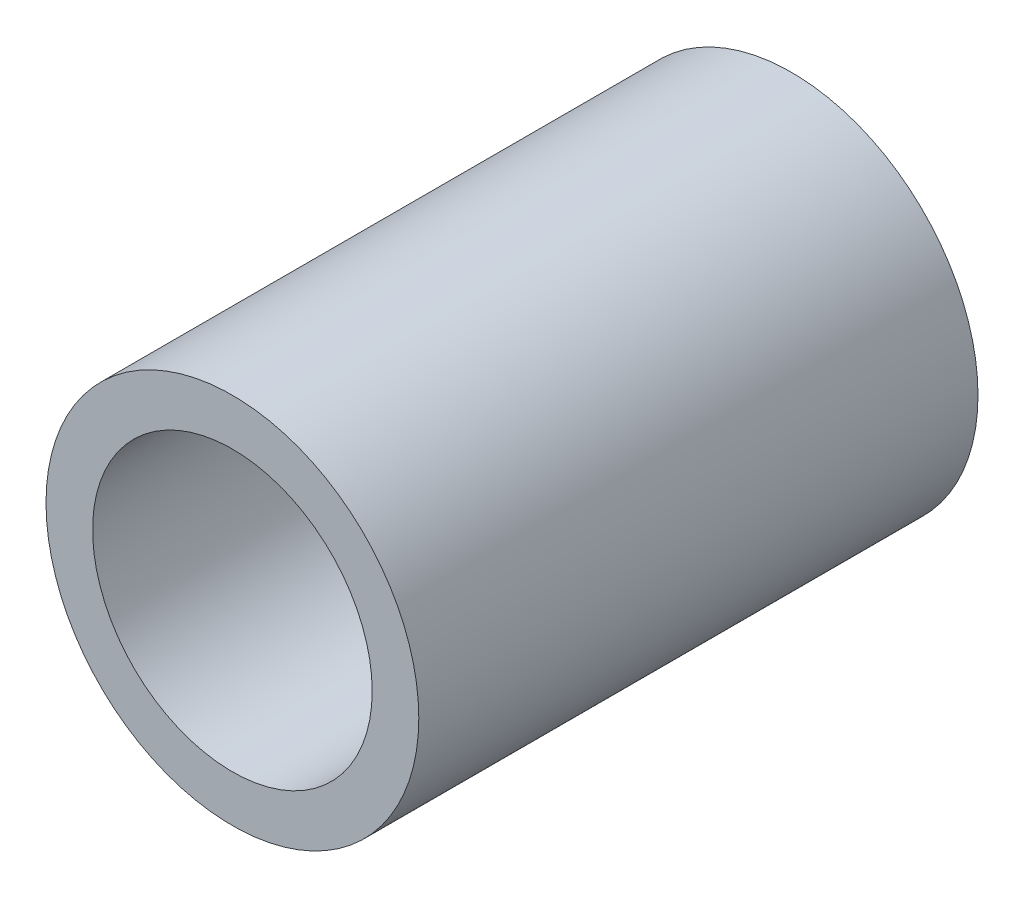
ISO-10303-21;
HEADER;
FILE_DESCRIPTION(('STEP AP214'),'2;1');
FILE_NAME('part.step','',(''),(''),'','','');
FILE_SCHEMA(('AUTOMOTIVE_DESIGN { 1 0 10303 214 1 1 1 1 }'));
ENDSEC;
DATA;
#1=APPLICATION_CONTEXT('core data for automotive mechanical design processes');
#2=APPLICATION_PROTOCOL_DEFINITION('international standard','automotive_design',2000,#1);
#3=PRODUCT_CONTEXT('',#1,'mechanical');
#4=PRODUCT('Part','Part','',(#3));
#5=PRODUCT_RELATED_PRODUCT_CATEGORY('part','',(#4));
#6=PRODUCT_DEFINITION_FORMATION('','',#4);
#7=PRODUCT_DEFINITION_CONTEXT('part definition',#1,'design');
#8=PRODUCT_DEFINITION('design','',#6,#7);
#9=PRODUCT_DEFINITION_SHAPE('','',#8);
#10=(LENGTH_UNIT() NAMED_UNIT(*) SI_UNIT(.MILLI.,.METRE.));
#11=(NAMED_UNIT(*) PLANE_ANGLE_UNIT() SI_UNIT($,.RADIAN.));
#12=(NAMED_UNIT(*) SI_UNIT($,.STERADIAN.) SOLID_ANGLE_UNIT());
#13=UNCERTAINTY_MEASURE_WITH_UNIT(LENGTH_MEASURE(1.E-05),#10,'distance_accuracy_value','');
#14=(GEOMETRIC_REPRESENTATION_CONTEXT(3) GLOBAL_UNCERTAINTY_ASSIGNED_CONTEXT((#13)) GLOBAL_UNIT_ASSIGNED_CONTEXT((#10,
#11,#12)) REPRESENTATION_CONTEXT('',''));
#15=CARTESIAN_POINT('',(0.,0.,0.));
#16=DIRECTION('',(0.,0.,1.));
#17=DIRECTION('',(1.,0.,0.));
#18=AXIS2_PLACEMENT_3D('',#15,#16,#17);
#19=CARTESIAN_POINT('',(0.,0.,76.2));
#20=DIRECTION('',(0.,0.,1.));
#21=DIRECTION('',(1.,0.,0.));
#22=AXIS2_PLACEMENT_3D('',#19,#20,#21);
#23=PLANE('',#22);
#24=CARTESIAN_POINT('',(0.,0.,76.2));
#25=DIRECTION('',(0.,0.,1.));
#26=DIRECTION('',(1.,0.,0.));
#27=AXIS2_PLACEMENT_3D('',#24,#25,#26);
#28=CIRCLE('',#27,25.4);
#29=CARTESIAN_POINT('',(25.4,0.,76.2));
#30=VERTEX_POINT('',#29);
#31=EDGE_CURVE('E10',#30,#30,#28,.T.);
#32=ORIENTED_EDGE('',*,*,#31,.T.);
#33=EDGE_LOOP('',(#32));
#34=FACE_BOUND('',#33,.T.);
#35=CARTESIAN_POINT('',(0.,0.,76.2));
#36=DIRECTION('',(0.,0.,1.));
#37=DIRECTION('',(1.,0.,0.));
#38=AXIS2_PLACEMENT_3D('',#35,#36,#37);
#39=CIRCLE('',#38,19.05);
#40=CARTESIAN_POINT('',(19.05,0.,76.2));
#41=VERTEX_POINT('',#40);
#42=EDGE_CURVE('E46',#41,#41,#39,.T.);
#43=ORIENTED_EDGE('',*,*,#42,.F.);
#44=EDGE_LOOP('',(#43));
#45=FACE_BOUND('',#44,.T.);
#46=ADVANCED_FACE('F35',(#34,#45),#23,.T.);
#47=CARTESIAN_POINT('',(0.,0.,0.));
#48=DIRECTION('',(0.,0.,1.));
#49=DIRECTION('',(1.,0.,0.));
#50=AXIS2_PLACEMENT_3D('',#47,#48,#49);
#51=PLANE('',#50);
#52=CARTESIAN_POINT('',(0.,0.,0.));
#53=DIRECTION('',(0.,0.,1.));
#54=DIRECTION('',(1.,0.,0.));
#55=AXIS2_PLACEMENT_3D('',#52,#53,#54);
#56=CIRCLE('',#55,25.4);
#57=CARTESIAN_POINT('',(25.4,0.,0.));
#58=VERTEX_POINT('',#57);
#59=EDGE_CURVE('E39',#58,#58,#56,.T.);
#60=ORIENTED_EDGE('',*,*,#59,.F.);
#61=EDGE_LOOP('',(#60));
#62=FACE_BOUND('',#61,.T.);
#63=CARTESIAN_POINT('',(0.,0.,0.));
#64=DIRECTION('',(0.,0.,1.));
#65=DIRECTION('',(1.,0.,0.));
#66=AXIS2_PLACEMENT_3D('',#63,#64,#65);
#67=CIRCLE('',#66,19.05);
#68=CARTESIAN_POINT('',(19.05,0.,0.));
#69=VERTEX_POINT('',#68);
#70=EDGE_CURVE('E48',#69,#69,#67,.T.);
#71=ORIENTED_EDGE('',*,*,#70,.T.);
#72=EDGE_LOOP('',(#71));
#73=FACE_BOUND('',#72,.T.);
#74=ADVANCED_FACE('F59',(#62,#73),#51,.F.);
#75=CARTESIAN_POINT('',(0.,0.,76.2));
#76=DIRECTION('',(0.,0.,-1.));
#77=DIRECTION('',(-1.,0.,0.));
#78=AXIS2_PLACEMENT_3D('',#75,#76,#77);
#79=CYLINDRICAL_SURFACE('',#78,25.4);
#80=ORIENTED_EDGE('',*,*,#31,.F.);
#81=EDGE_LOOP('',(#80));
#82=FACE_BOUND('',#81,.T.);
#83=ORIENTED_EDGE('',*,*,#59,.T.);
#84=EDGE_LOOP('',(#83));
#85=FACE_BOUND('',#84,.T.);
#86=ADVANCED_FACE('F37',(#82,#85),#79,.T.);
#87=CARTESIAN_POINT('',(0.,0.,76.2));
#88=DIRECTION('',(0.,0.,-1.));
#89=DIRECTION('',(-1.,0.,0.));
#90=AXIS2_PLACEMENT_3D('',#87,#88,#89);
#91=CYLINDRICAL_SURFACE('',#90,19.05);
#92=ORIENTED_EDGE('',*,*,#42,.T.);
#93=EDGE_LOOP('',(#92));
#94=FACE_BOUND('',#93,.T.);
#95=ORIENTED_EDGE('',*,*,#70,.F.);
#96=EDGE_LOOP('',(#95));
#97=FACE_BOUND('',#96,.T.);
#98=ADVANCED_FACE('F55',(#94,#97),#91,.F.);
#99=CLOSED_SHELL('',(#46,#74,#86,#98));
#100=MANIFOLD_SOLID_BREP('B2',#99);
#101=ADVANCED_BREP_SHAPE_REPRESENTATION('',(#18,#100),#14);
#102=SHAPE_DEFINITION_REPRESENTATION(#9,#101);
ENDSEC;
END-ISO-10303-21;
